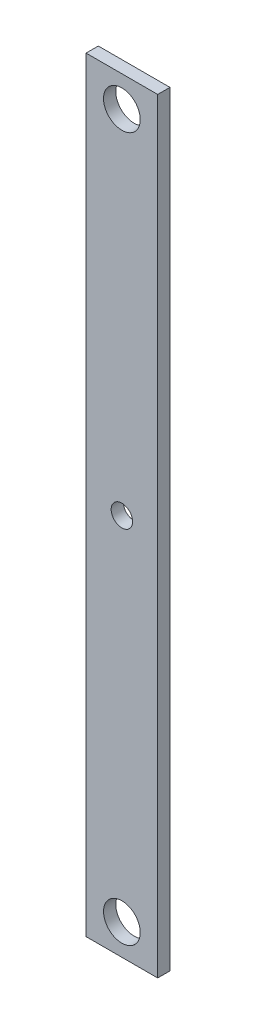
ISO-10303-21;
HEADER;
FILE_DESCRIPTION(('STEP AP214'),'2;1');
FILE_NAME('part.step','',(''),(''),'','','');
FILE_SCHEMA(('AUTOMOTIVE_DESIGN { 1 0 10303 214 1 1 1 1 }'));
ENDSEC;
DATA;
#1=APPLICATION_CONTEXT('core data for automotive mechanical design processes');
#2=APPLICATION_PROTOCOL_DEFINITION('international standard','automotive_design',2000,#1);
#3=PRODUCT_CONTEXT('',#1,'mechanical');
#4=PRODUCT('Part','Part','',(#3));
#5=PRODUCT_RELATED_PRODUCT_CATEGORY('part','',(#4));
#6=PRODUCT_DEFINITION_FORMATION('','',#4);
#7=PRODUCT_DEFINITION_CONTEXT('part definition',#1,'design');
#8=PRODUCT_DEFINITION('design','',#6,#7);
#9=PRODUCT_DEFINITION_SHAPE('','',#8);
#10=(LENGTH_UNIT() NAMED_UNIT(*) SI_UNIT(.MILLI.,.METRE.));
#11=(NAMED_UNIT(*) PLANE_ANGLE_UNIT() SI_UNIT($,.RADIAN.));
#12=(NAMED_UNIT(*) SI_UNIT($,.STERADIAN.) SOLID_ANGLE_UNIT());
#13=UNCERTAINTY_MEASURE_WITH_UNIT(LENGTH_MEASURE(1.E-05),#10,'distance_accuracy_value','');
#14=(GEOMETRIC_REPRESENTATION_CONTEXT(3) GLOBAL_UNCERTAINTY_ASSIGNED_CONTEXT((#13)) GLOBAL_UNIT_ASSIGNED_CONTEXT((#10,
#11,#12)) REPRESENTATION_CONTEXT('',''));
#15=CARTESIAN_POINT('',(0.,0.,0.));
#16=DIRECTION('',(0.,0.,1.));
#17=DIRECTION('',(1.,0.,0.));
#18=AXIS2_PLACEMENT_3D('',#15,#16,#17);
#19=CARTESIAN_POINT('',(5.85,-62.5,1.));
#20=DIRECTION('',(-1.,0.,0.));
#21=DIRECTION('',(0.,0.,1.));
#22=AXIS2_PLACEMENT_3D('',#19,#20,#21);
#23=PLANE('',#22);
#24=DIRECTION('',(0.,1.,0.));
#25=VECTOR('',#24,1.);
#26=CARTESIAN_POINT('',(5.85,-62.5,-1.));
#27=LINE('',#26,#25);
#28=CARTESIAN_POINT('',(5.85,-62.5,-1.));
#29=VERTEX_POINT('',#28);
#30=CARTESIAN_POINT('',(5.85,62.5,-1.));
#31=VERTEX_POINT('',#30);
#32=EDGE_CURVE('E108',#29,#31,#27,.T.);
#33=ORIENTED_EDGE('',*,*,#32,.T.);
#34=DIRECTION('',(0.,0.,-1.));
#35=VECTOR('',#34,1.);
#36=CARTESIAN_POINT('',(5.85,62.5,1.));
#37=LINE('',#36,#35);
#38=CARTESIAN_POINT('',(5.85,62.5,1.));
#39=VERTEX_POINT('',#38);
#40=EDGE_CURVE('E11',#39,#31,#37,.T.);
#41=ORIENTED_EDGE('',*,*,#40,.F.);
#42=DIRECTION('',(0.,1.,0.));
#43=VECTOR('',#42,1.);
#44=CARTESIAN_POINT('',(5.85,-62.5,1.));
#45=LINE('',#44,#43);
#46=CARTESIAN_POINT('',(5.85,-62.5,1.));
#47=VERTEX_POINT('',#46);
#48=EDGE_CURVE('E91',#47,#39,#45,.T.);
#49=ORIENTED_EDGE('',*,*,#48,.F.);
#50=DIRECTION('',(0.,0.,-1.));
#51=VECTOR('',#50,1.);
#52=CARTESIAN_POINT('',(5.85,-62.5,1.));
#53=LINE('',#52,#51);
#54=EDGE_CURVE('E104',#47,#29,#53,.T.);
#55=ORIENTED_EDGE('',*,*,#54,.T.);
#56=EDGE_LOOP('',(#33,#41,#49,#55));
#57=FACE_BOUND('',#56,.T.);
#58=ADVANCED_FACE('F38',(#57),#23,.F.);
#59=CARTESIAN_POINT('',(-5.85,62.5,1.));
#60=DIRECTION('',(0.,-1.,0.));
#61=DIRECTION('',(0.,0.,-1.));
#62=AXIS2_PLACEMENT_3D('',#59,#60,#61);
#63=PLANE('',#62);
#64=DIRECTION('',(-1.,0.,0.));
#65=VECTOR('',#64,1.);
#66=CARTESIAN_POINT('',(-5.85,62.5,-1.));
#67=LINE('',#66,#65);
#68=CARTESIAN_POINT('',(-5.85,62.5,-1.));
#69=VERTEX_POINT('',#68);
#70=EDGE_CURVE('E96',#31,#69,#67,.T.);
#71=ORIENTED_EDGE('',*,*,#70,.T.);
#72=DIRECTION('',(0.,0.,-1.));
#73=VECTOR('',#72,1.);
#74=CARTESIAN_POINT('',(-5.85,62.5,1.));
#75=LINE('',#74,#73);
#76=CARTESIAN_POINT('',(-5.85,62.5,1.));
#77=VERTEX_POINT('',#76);
#78=EDGE_CURVE('E48',#77,#69,#75,.T.);
#79=ORIENTED_EDGE('',*,*,#78,.F.);
#80=DIRECTION('',(-1.,0.,0.));
#81=VECTOR('',#80,1.);
#82=CARTESIAN_POINT('',(-5.85,62.5,1.));
#83=LINE('',#82,#81);
#84=EDGE_CURVE('E86',#39,#77,#83,.T.);
#85=ORIENTED_EDGE('',*,*,#84,.F.);
#86=ORIENTED_EDGE('',*,*,#40,.T.);
#87=EDGE_LOOP('',(#71,#79,#85,#86));
#88=FACE_BOUND('',#87,.T.);
#89=ADVANCED_FACE('F95',(#88),#63,.F.);
#90=CARTESIAN_POINT('',(-5.85,-62.5,1.));
#91=DIRECTION('',(1.,0.,0.));
#92=DIRECTION('',(0.,0.,-1.));
#93=AXIS2_PLACEMENT_3D('',#90,#91,#92);
#94=PLANE('',#93);
#95=DIRECTION('',(0.,-1.,0.));
#96=VECTOR('',#95,1.);
#97=CARTESIAN_POINT('',(-5.85,-62.5,-1.));
#98=LINE('',#97,#96);
#99=CARTESIAN_POINT('',(-5.85,-62.5,-1.));
#100=VERTEX_POINT('',#99);
#101=EDGE_CURVE('E73',#69,#100,#98,.T.);
#102=ORIENTED_EDGE('',*,*,#101,.T.);
#103=DIRECTION('',(0.,0.,-1.));
#104=VECTOR('',#103,1.);
#105=CARTESIAN_POINT('',(-5.85,-62.5,1.));
#106=LINE('',#105,#104);
#107=CARTESIAN_POINT('',(-5.85,-62.5,1.));
#108=VERTEX_POINT('',#107);
#109=EDGE_CURVE('E98',#108,#100,#106,.T.);
#110=ORIENTED_EDGE('',*,*,#109,.F.);
#111=DIRECTION('',(0.,-1.,0.));
#112=VECTOR('',#111,1.);
#113=CARTESIAN_POINT('',(-5.85,-62.5,1.));
#114=LINE('',#113,#112);
#115=EDGE_CURVE('E89',#77,#108,#114,.T.);
#116=ORIENTED_EDGE('',*,*,#115,.F.);
#117=ORIENTED_EDGE('',*,*,#78,.T.);
#118=EDGE_LOOP('',(#102,#110,#116,#117));
#119=FACE_BOUND('',#118,.T.);
#120=ADVANCED_FACE('F100',(#119),#94,.F.);
#121=CARTESIAN_POINT('',(-5.85,-62.5,1.));
#122=DIRECTION('',(0.,1.,0.));
#123=DIRECTION('',(0.,0.,1.));
#124=AXIS2_PLACEMENT_3D('',#121,#122,#123);
#125=PLANE('',#124);
#126=DIRECTION('',(1.,0.,0.));
#127=VECTOR('',#126,1.);
#128=CARTESIAN_POINT('',(-5.85,-62.5,-1.));
#129=LINE('',#128,#127);
#130=EDGE_CURVE('E79',#100,#29,#129,.T.);
#131=ORIENTED_EDGE('',*,*,#130,.T.);
#132=ORIENTED_EDGE('',*,*,#54,.F.);
#133=DIRECTION('',(1.,0.,0.));
#134=VECTOR('',#133,1.);
#135=CARTESIAN_POINT('',(-5.85,-62.5,1.));
#136=LINE('',#135,#134);
#137=EDGE_CURVE('E56',#108,#47,#136,.T.);
#138=ORIENTED_EDGE('',*,*,#137,.F.);
#139=ORIENTED_EDGE('',*,*,#109,.T.);
#140=EDGE_LOOP('',(#131,#132,#138,#139));
#141=FACE_BOUND('',#140,.T.);
#142=ADVANCED_FACE('F122',(#141),#125,.F.);
#143=CARTESIAN_POINT('',(0.,0.,1.));
#144=DIRECTION('',(0.,0.,-1.));
#145=DIRECTION('',(-1.,0.,0.));
#146=AXIS2_PLACEMENT_3D('',#143,#144,#145);
#147=PLANE('',#146);
#148=CARTESIAN_POINT('',(0.,0.,1.));
#149=DIRECTION('',(0.,0.,1.));
#150=DIRECTION('',(1.,0.,0.));
#151=AXIS2_PLACEMENT_3D('',#148,#149,#150);
#152=CIRCLE('',#151,1.75);
#153=CARTESIAN_POINT('',(1.75,0.,1.));
#154=VERTEX_POINT('',#153);
#155=EDGE_CURVE('E144',#154,#154,#152,.T.);
#156=ORIENTED_EDGE('',*,*,#155,.F.);
#157=EDGE_LOOP('',(#156));
#158=FACE_BOUND('',#157,.T.);
#159=CARTESIAN_POINT('',(0.,57.5,1.));
#160=DIRECTION('',(0.,0.,1.));
#161=DIRECTION('',(1.,0.,0.));
#162=AXIS2_PLACEMENT_3D('',#159,#160,#161);
#163=CIRCLE('',#162,3.);
#164=CARTESIAN_POINT('',(3.,57.5,1.));
#165=VERTEX_POINT('',#164);
#166=EDGE_CURVE('E137',#165,#165,#163,.T.);
#167=ORIENTED_EDGE('',*,*,#166,.F.);
#168=EDGE_LOOP('',(#167));
#169=FACE_BOUND('',#168,.T.);
#170=CARTESIAN_POINT('',(0.,-57.5,1.));
#171=DIRECTION('',(0.,0.,1.));
#172=DIRECTION('',(1.,0.,0.));
#173=AXIS2_PLACEMENT_3D('',#170,#171,#172);
#174=CIRCLE('',#173,3.);
#175=CARTESIAN_POINT('',(3.,-57.5,1.));
#176=VERTEX_POINT('',#175);
#177=EDGE_CURVE('E129',#176,#176,#174,.T.);
#178=ORIENTED_EDGE('',*,*,#177,.F.);
#179=EDGE_LOOP('',(#178));
#180=FACE_BOUND('',#179,.T.);
#181=ORIENTED_EDGE('',*,*,#48,.T.);
#182=ORIENTED_EDGE('',*,*,#84,.T.);
#183=ORIENTED_EDGE('',*,*,#115,.T.);
#184=ORIENTED_EDGE('',*,*,#137,.T.);
#185=EDGE_LOOP('',(#181,#182,#183,#184));
#186=FACE_BOUND('',#185,.T.);
#187=ADVANCED_FACE('F87',(#158,#169,#180,#186),#147,.F.);
#188=CARTESIAN_POINT('',(0.,0.,-1.));
#189=DIRECTION('',(0.,0.,-1.));
#190=DIRECTION('',(-1.,0.,0.));
#191=AXIS2_PLACEMENT_3D('',#188,#189,#190);
#192=PLANE('',#191);
#193=CARTESIAN_POINT('',(0.,0.,-1.));
#194=DIRECTION('',(0.,0.,-1.));
#195=DIRECTION('',(-1.,0.,0.));
#196=AXIS2_PLACEMENT_3D('',#193,#194,#195);
#197=CIRCLE('',#196,1.75);
#198=CARTESIAN_POINT('',(-1.75,0.,-1.));
#199=VERTEX_POINT('',#198);
#200=EDGE_CURVE('E41',#199,#199,#197,.T.);
#201=ORIENTED_EDGE('',*,*,#200,.F.);
#202=EDGE_LOOP('',(#201));
#203=FACE_BOUND('',#202,.T.);
#204=CARTESIAN_POINT('',(0.,57.5,-1.));
#205=DIRECTION('',(0.,0.,1.));
#206=DIRECTION('',(1.,0.,0.));
#207=AXIS2_PLACEMENT_3D('',#204,#205,#206);
#208=CIRCLE('',#207,3.);
#209=CARTESIAN_POINT('',(3.,57.5,-1.));
#210=VERTEX_POINT('',#209);
#211=EDGE_CURVE('E112',#210,#210,#208,.T.);
#212=ORIENTED_EDGE('',*,*,#211,.T.);
#213=EDGE_LOOP('',(#212));
#214=FACE_BOUND('',#213,.T.);
#215=CARTESIAN_POINT('',(0.,-57.5,-1.));
#216=DIRECTION('',(0.,0.,1.));
#217=DIRECTION('',(1.,0.,0.));
#218=AXIS2_PLACEMENT_3D('',#215,#216,#217);
#219=CIRCLE('',#218,3.);
#220=CARTESIAN_POINT('',(3.,-57.5,-1.));
#221=VERTEX_POINT('',#220);
#222=EDGE_CURVE('E133',#221,#221,#219,.T.);
#223=ORIENTED_EDGE('',*,*,#222,.T.);
#224=EDGE_LOOP('',(#223));
#225=FACE_BOUND('',#224,.T.);
#226=ORIENTED_EDGE('',*,*,#32,.F.);
#227=ORIENTED_EDGE('',*,*,#130,.F.);
#228=ORIENTED_EDGE('',*,*,#101,.F.);
#229=ORIENTED_EDGE('',*,*,#70,.F.);
#230=EDGE_LOOP('',(#226,#227,#228,#229));
#231=FACE_BOUND('',#230,.T.);
#232=ADVANCED_FACE('F125',(#203,#214,#225,#231),#192,.T.);
#233=CARTESIAN_POINT('',(0.,-57.5,-1.));
#234=DIRECTION('',(0.,0.,1.));
#235=DIRECTION('',(1.,0.,0.));
#236=AXIS2_PLACEMENT_3D('',#233,#234,#235);
#237=CYLINDRICAL_SURFACE('',#236,3.);
#238=ORIENTED_EDGE('',*,*,#222,.F.);
#239=EDGE_LOOP('',(#238));
#240=FACE_BOUND('',#239,.T.);
#241=ORIENTED_EDGE('',*,*,#177,.T.);
#242=EDGE_LOOP('',(#241));
#243=FACE_BOUND('',#242,.T.);
#244=ADVANCED_FACE('F157',(#240,#243),#237,.F.);
#245=CARTESIAN_POINT('',(0.,57.5,-1.));
#246=DIRECTION('',(0.,0.,1.));
#247=DIRECTION('',(1.,0.,0.));
#248=AXIS2_PLACEMENT_3D('',#245,#246,#247);
#249=CYLINDRICAL_SURFACE('',#248,3.);
#250=ORIENTED_EDGE('',*,*,#211,.F.);
#251=EDGE_LOOP('',(#250));
#252=FACE_BOUND('',#251,.T.);
#253=ORIENTED_EDGE('',*,*,#166,.T.);
#254=EDGE_LOOP('',(#253));
#255=FACE_BOUND('',#254,.T.);
#256=ADVANCED_FACE('F165',(#252,#255),#249,.F.);
#257=CARTESIAN_POINT('',(0.,0.,-9.));
#258=DIRECTION('',(0.,0.,1.));
#259=DIRECTION('',(1.,0.,0.));
#260=AXIS2_PLACEMENT_3D('',#257,#258,#259);
#261=CYLINDRICAL_SURFACE('',#260,1.75);
#262=ORIENTED_EDGE('',*,*,#200,.T.);
#263=EDGE_LOOP('',(#262));
#264=FACE_BOUND('',#263,.T.);
#265=ORIENTED_EDGE('',*,*,#155,.T.);
#266=EDGE_LOOP('',(#265));
#267=FACE_BOUND('',#266,.T.);
#268=ADVANCED_FACE('F153',(#264,#267),#261,.F.);
#269=CLOSED_SHELL('',(#58,#89,#120,#142,#187,#232,#244,#256,#268));
#270=MANIFOLD_SOLID_BREP('B2',#269);
#271=ADVANCED_BREP_SHAPE_REPRESENTATION('',(#18,#270),#14);
#272=SHAPE_DEFINITION_REPRESENTATION(#9,#271);
ENDSEC;
END-ISO-10303-21;
